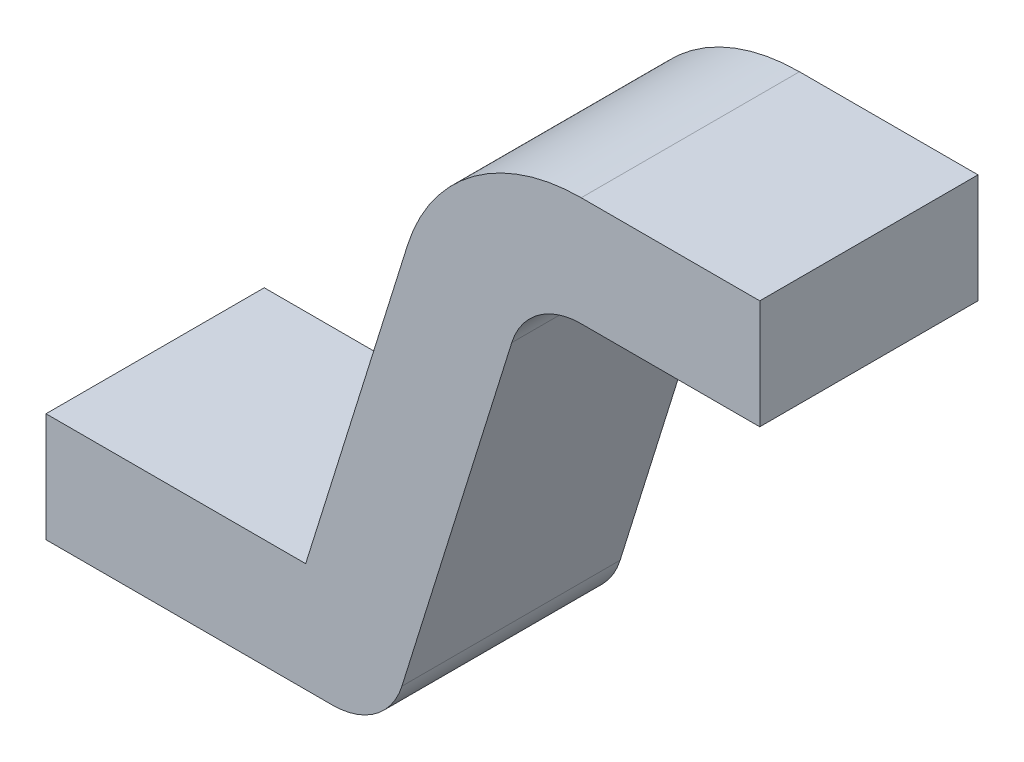
ISO-10303-21;
HEADER;
FILE_DESCRIPTION(('STEP AP214'),'2;1');
FILE_NAME('part.step','',(''),(''),'','','');
FILE_SCHEMA(('AUTOMOTIVE_DESIGN { 1 0 10303 214 1 1 1 1 }'));
ENDSEC;
DATA;
#1=APPLICATION_CONTEXT('core data for automotive mechanical design processes');
#2=APPLICATION_PROTOCOL_DEFINITION('international standard','automotive_design',2000,#1);
#3=PRODUCT_CONTEXT('',#1,'mechanical');
#4=PRODUCT('Part','Part','',(#3));
#5=PRODUCT_RELATED_PRODUCT_CATEGORY('part','',(#4));
#6=PRODUCT_DEFINITION_FORMATION('','',#4);
#7=PRODUCT_DEFINITION_CONTEXT('part definition',#1,'design');
#8=PRODUCT_DEFINITION('design','',#6,#7);
#9=PRODUCT_DEFINITION_SHAPE('','',#8);
#10=(LENGTH_UNIT() NAMED_UNIT(*) SI_UNIT(.MILLI.,.METRE.));
#11=(NAMED_UNIT(*) PLANE_ANGLE_UNIT() SI_UNIT($,.RADIAN.));
#12=(NAMED_UNIT(*) SI_UNIT($,.STERADIAN.) SOLID_ANGLE_UNIT());
#13=UNCERTAINTY_MEASURE_WITH_UNIT(LENGTH_MEASURE(1.E-05),#10,'distance_accuracy_value','');
#14=(GEOMETRIC_REPRESENTATION_CONTEXT(3) GLOBAL_UNCERTAINTY_ASSIGNED_CONTEXT((#13)) GLOBAL_UNIT_ASSIGNED_CONTEXT((#10,
#11,#12)) REPRESENTATION_CONTEXT('',''));
#15=CARTESIAN_POINT('',(0.,0.,0.));
#16=DIRECTION('',(0.,0.,1.));
#17=DIRECTION('',(1.,0.,0.));
#18=AXIS2_PLACEMENT_3D('',#15,#16,#17);
#19=CARTESIAN_POINT('',(0.,0.15,0.3));
#20=DIRECTION('',(1.,0.,0.));
#21=DIRECTION('',(0.,0.,-1.));
#22=AXIS2_PLACEMENT_3D('',#19,#20,#21);
#23=PLANE('',#22);
#24=DIRECTION('',(0.,-1.,0.));
#25=VECTOR('',#24,1.);
#26=CARTESIAN_POINT('',(0.,0.15,0.));
#27=LINE('',#26,#25);
#28=CARTESIAN_POINT('',(0.,0.15,0.));
#29=VERTEX_POINT('',#28);
#30=CARTESIAN_POINT('',(0.,0.,0.));
#31=VERTEX_POINT('',#30);
#32=EDGE_CURVE('E144',#29,#31,#27,.T.);
#33=ORIENTED_EDGE('',*,*,#32,.T.);
#34=DIRECTION('',(0.,0.,-1.));
#35=VECTOR('',#34,1.);
#36=CARTESIAN_POINT('',(0.,0.,0.3));
#37=LINE('',#36,#35);
#38=CARTESIAN_POINT('',(0.,0.,0.3));
#39=VERTEX_POINT('',#38);
#40=EDGE_CURVE('E11',#39,#31,#37,.T.);
#41=ORIENTED_EDGE('',*,*,#40,.F.);
#42=DIRECTION('',(0.,-1.,0.));
#43=VECTOR('',#42,1.);
#44=CARTESIAN_POINT('',(0.,0.15,0.3));
#45=LINE('',#44,#43);
#46=CARTESIAN_POINT('',(0.,0.15,0.3));
#47=VERTEX_POINT('',#46);
#48=EDGE_CURVE('E164',#47,#39,#45,.T.);
#49=ORIENTED_EDGE('',*,*,#48,.F.);
#50=DIRECTION('',(0.,0.,-1.));
#51=VECTOR('',#50,1.);
#52=CARTESIAN_POINT('',(0.,0.15,0.3));
#53=LINE('',#52,#51);
#54=EDGE_CURVE('E140',#47,#29,#53,.T.);
#55=ORIENTED_EDGE('',*,*,#54,.T.);
#56=EDGE_LOOP('',(#33,#41,#49,#55));
#57=FACE_BOUND('',#56,.T.);
#58=ADVANCED_FACE('F30',(#57),#23,.F.);
#59=CARTESIAN_POINT('',(0.,0.,0.3));
#60=DIRECTION('',(0.,1.,0.));
#61=DIRECTION('',(0.,0.,1.));
#62=AXIS2_PLACEMENT_3D('',#59,#60,#61);
#63=PLANE('',#62);
#64=DIRECTION('',(1.,0.,0.));
#65=VECTOR('',#64,1.);
#66=CARTESIAN_POINT('',(0.,0.,0.));
#67=LINE('',#66,#65);
#68=CARTESIAN_POINT('',(0.393749668926178,0.,0.));
#69=VERTEX_POINT('',#68);
#70=EDGE_CURVE('E147',#31,#69,#67,.T.);
#71=ORIENTED_EDGE('',*,*,#70,.T.);
#72=DIRECTION('',(0.,0.,-1.));
#73=VECTOR('',#72,1.);
#74=CARTESIAN_POINT('',(0.393749668926178,0.,0.3));
#75=LINE('',#74,#73);
#76=CARTESIAN_POINT('',(0.393749668926178,0.,0.3));
#77=VERTEX_POINT('',#76);
#78=EDGE_CURVE('E38',#77,#69,#75,.T.);
#79=ORIENTED_EDGE('',*,*,#78,.F.);
#80=DIRECTION('',(1.,0.,0.));
#81=VECTOR('',#80,1.);
#82=CARTESIAN_POINT('',(0.,0.,0.3));
#83=LINE('',#82,#81);
#84=EDGE_CURVE('E98',#39,#77,#83,.T.);
#85=ORIENTED_EDGE('',*,*,#84,.F.);
#86=ORIENTED_EDGE('',*,*,#40,.T.);
#87=EDGE_LOOP('',(#71,#79,#85,#86));
#88=FACE_BOUND('',#87,.T.);
#89=ADVANCED_FACE('F236',(#88),#63,.F.);
#90=CARTESIAN_POINT('',(0.393749668926178,0.1,0.3));
#91=DIRECTION('',(0.,0.,-1.));
#92=DIRECTION('',(-1.,0.,0.));
#93=AXIS2_PLACEMENT_3D('',#90,#91,#92);
#94=CYLINDRICAL_SURFACE('',#93,0.1);
#95=CARTESIAN_POINT('',(0.393749668926178,0.1,0.));
#96=DIRECTION('',(0.,0.,1.));
#97=DIRECTION('',(-1.,0.,0.));
#98=AXIS2_PLACEMENT_3D('',#95,#96,#97);
#99=CIRCLE('',#98,0.1);
#100=CARTESIAN_POINT('',(0.489218964277052,0.0702407384969382,0.));
#101=VERTEX_POINT('',#100);
#102=EDGE_CURVE('E149',#69,#101,#99,.T.);
#103=ORIENTED_EDGE('',*,*,#102,.T.);
#104=DIRECTION('',(0.,0.,-1.));
#105=VECTOR('',#104,1.);
#106=CARTESIAN_POINT('',(0.489218964277052,0.0702407384969382,0.3));
#107=LINE('',#106,#105);
#108=CARTESIAN_POINT('',(0.489218964277052,0.0702407384969382,0.3));
#109=VERTEX_POINT('',#108);
#110=EDGE_CURVE('E180',#109,#101,#107,.T.);
#111=ORIENTED_EDGE('',*,*,#110,.F.);
#112=CARTESIAN_POINT('',(0.393749668926178,0.1,0.3));
#113=DIRECTION('',(0.,0.,1.));
#114=DIRECTION('',(-1.,0.,0.));
#115=AXIS2_PLACEMENT_3D('',#112,#113,#114);
#116=CIRCLE('',#115,0.1);
#117=EDGE_CURVE('E188',#77,#109,#116,.T.);
#118=ORIENTED_EDGE('',*,*,#117,.F.);
#119=ORIENTED_EDGE('',*,*,#78,.T.);
#120=EDGE_LOOP('',(#103,#111,#118,#119));
#121=FACE_BOUND('',#120,.T.);
#122=ADVANCED_FACE('F186',(#121),#94,.T.);
#123=CARTESIAN_POINT('',(0.489218964277052,0.0702407384969381,0.3));
#124=DIRECTION('',(-0.954692953508738,0.297592615030619,0.));
#125=DIRECTION('',(-0.297592615030619,-0.954692953508738,0.));
#126=AXIS2_PLACEMENT_3D('',#123,#124,#125);
#127=PLANE('',#126);
#128=DIRECTION('',(0.297592615030619,0.954692953508738,0.));
#129=VECTOR('',#128,1.);
#130=CARTESIAN_POINT('',(0.489218964277052,0.0702407384969381,0.));
#131=LINE('',#130,#129);
#132=CARTESIAN_POINT('',(0.640250909953653,0.554759261503062,0.));
#133=VERTEX_POINT('',#132);
#134=EDGE_CURVE('E151',#101,#133,#131,.T.);
#135=ORIENTED_EDGE('',*,*,#134,.T.);
#136=DIRECTION('',(0.,0.,-1.));
#137=VECTOR('',#136,1.);
#138=CARTESIAN_POINT('',(0.640250909953653,0.554759261503062,0.3));
#139=LINE('',#138,#137);
#140=CARTESIAN_POINT('',(0.640250909953653,0.554759261503062,0.3));
#141=VERTEX_POINT('',#140);
#142=EDGE_CURVE('E177',#141,#133,#139,.T.);
#143=ORIENTED_EDGE('',*,*,#142,.F.);
#144=DIRECTION('',(0.297592615030619,0.954692953508738,0.));
#145=VECTOR('',#144,1.);
#146=CARTESIAN_POINT('',(0.489218964277052,0.0702407384969381,0.3));
#147=LINE('',#146,#145);
#148=EDGE_CURVE('E206',#109,#141,#147,.T.);
#149=ORIENTED_EDGE('',*,*,#148,.F.);
#150=ORIENTED_EDGE('',*,*,#110,.T.);
#151=EDGE_LOOP('',(#135,#143,#149,#150));
#152=FACE_BOUND('',#151,.T.);
#153=ADVANCED_FACE('F197',(#152),#127,.F.);
#154=CARTESIAN_POINT('',(0.735720205304527,0.525,0.3));
#155=DIRECTION('',(0.,0.,-1.));
#156=DIRECTION('',(-1.,0.,0.));
#157=AXIS2_PLACEMENT_3D('',#154,#155,#156);
#158=CYLINDRICAL_SURFACE('',#157,0.1);
#159=CARTESIAN_POINT('',(0.735720205304527,0.525,0.));
#160=DIRECTION('',(0.,0.,-1.));
#161=DIRECTION('',(1.,0.,0.));
#162=AXIS2_PLACEMENT_3D('',#159,#160,#161);
#163=CIRCLE('',#162,0.1);
#164=CARTESIAN_POINT('',(0.735720205304527,0.625,0.));
#165=VERTEX_POINT('',#164);
#166=EDGE_CURVE('E153',#133,#165,#163,.T.);
#167=ORIENTED_EDGE('',*,*,#166,.T.);
#168=DIRECTION('',(0.,0.,-1.));
#169=VECTOR('',#168,1.);
#170=CARTESIAN_POINT('',(0.735720205304527,0.625,0.3));
#171=LINE('',#170,#169);
#172=CARTESIAN_POINT('',(0.735720205304527,0.625,0.3));
#173=VERTEX_POINT('',#172);
#174=EDGE_CURVE('E174',#173,#165,#171,.T.);
#175=ORIENTED_EDGE('',*,*,#174,.F.);
#176=CARTESIAN_POINT('',(0.735720205304527,0.525,0.3));
#177=DIRECTION('',(0.,0.,-1.));
#178=DIRECTION('',(1.,0.,0.));
#179=AXIS2_PLACEMENT_3D('',#176,#177,#178);
#180=CIRCLE('',#179,0.1);
#181=EDGE_CURVE('E203',#141,#173,#180,.T.);
#182=ORIENTED_EDGE('',*,*,#181,.F.);
#183=ORIENTED_EDGE('',*,*,#142,.T.);
#184=EDGE_LOOP('',(#167,#175,#182,#183));
#185=FACE_BOUND('',#184,.T.);
#186=ADVANCED_FACE('F201',(#185),#158,.F.);
#187=CARTESIAN_POINT('',(0.735720205304527,0.625,0.3));
#188=DIRECTION('',(0.,1.,0.));
#189=DIRECTION('',(-1.,0.,0.));
#190=AXIS2_PLACEMENT_3D('',#187,#188,#189);
#191=PLANE('',#190);
#192=DIRECTION('',(1.,0.,0.));
#193=VECTOR('',#192,1.);
#194=CARTESIAN_POINT('',(0.735720205304527,0.625,0.));
#195=LINE('',#194,#193);
#196=CARTESIAN_POINT('',(0.981168201486143,0.625,0.));
#197=VERTEX_POINT('',#196);
#198=EDGE_CURVE('E155',#165,#197,#195,.T.);
#199=ORIENTED_EDGE('',*,*,#198,.T.);
#200=DIRECTION('',(0.,0.,-1.));
#201=VECTOR('',#200,1.);
#202=CARTESIAN_POINT('',(0.981168201486143,0.625,0.3));
#203=LINE('',#202,#201);
#204=CARTESIAN_POINT('',(0.981168201486143,0.625,0.3));
#205=VERTEX_POINT('',#204);
#206=EDGE_CURVE('E171',#205,#197,#203,.T.);
#207=ORIENTED_EDGE('',*,*,#206,.F.);
#208=DIRECTION('',(1.,0.,0.));
#209=VECTOR('',#208,1.);
#210=CARTESIAN_POINT('',(0.735720205304527,0.625,0.3));
#211=LINE('',#210,#209);
#212=EDGE_CURVE('E205',#173,#205,#211,.T.);
#213=ORIENTED_EDGE('',*,*,#212,.F.);
#214=ORIENTED_EDGE('',*,*,#174,.T.);
#215=EDGE_LOOP('',(#199,#207,#213,#214));
#216=FACE_BOUND('',#215,.T.);
#217=ADVANCED_FACE('F249',(#216),#191,.F.);
#218=CARTESIAN_POINT('',(0.981168201486143,0.775,0.3));
#219=DIRECTION('',(-1.,0.,0.));
#220=DIRECTION('',(0.,0.,1.));
#221=AXIS2_PLACEMENT_3D('',#218,#219,#220);
#222=PLANE('',#221);
#223=DIRECTION('',(0.,1.,0.));
#224=VECTOR('',#223,1.);
#225=CARTESIAN_POINT('',(0.981168201486143,0.775,0.));
#226=LINE('',#225,#224);
#227=CARTESIAN_POINT('',(0.981168201486143,0.775,0.));
#228=VERTEX_POINT('',#227);
#229=EDGE_CURVE('E157',#197,#228,#226,.T.);
#230=ORIENTED_EDGE('',*,*,#229,.T.);
#231=DIRECTION('',(0.,0.,-1.));
#232=VECTOR('',#231,1.);
#233=CARTESIAN_POINT('',(0.981168201486143,0.775,0.3));
#234=LINE('',#233,#232);
#235=CARTESIAN_POINT('',(0.981168201486143,0.775,0.3));
#236=VERTEX_POINT('',#235);
#237=EDGE_CURVE('E168',#236,#228,#234,.T.);
#238=ORIENTED_EDGE('',*,*,#237,.F.);
#239=DIRECTION('',(0.,1.,0.));
#240=VECTOR('',#239,1.);
#241=CARTESIAN_POINT('',(0.981168201486143,0.775,0.3));
#242=LINE('',#241,#240);
#243=EDGE_CURVE('E208',#205,#236,#242,.T.);
#244=ORIENTED_EDGE('',*,*,#243,.F.);
#245=ORIENTED_EDGE('',*,*,#206,.T.);
#246=EDGE_LOOP('',(#230,#238,#244,#245));
#247=FACE_BOUND('',#246,.T.);
#248=ADVANCED_FACE('F217',(#247),#222,.F.);
#249=CARTESIAN_POINT('',(0.735720205304527,0.775,0.3));
#250=DIRECTION('',(0.,-1.,0.));
#251=DIRECTION('',(0.,0.,-1.));
#252=AXIS2_PLACEMENT_3D('',#249,#250,#251);
#253=PLANE('',#252);
#254=DIRECTION('',(-1.,0.,0.));
#255=VECTOR('',#254,1.);
#256=CARTESIAN_POINT('',(0.735720205304527,0.775,0.));
#257=LINE('',#256,#255);
#258=CARTESIAN_POINT('',(0.735720205304527,0.775,0.));
#259=VERTEX_POINT('',#258);
#260=EDGE_CURVE('E159',#228,#259,#257,.T.);
#261=ORIENTED_EDGE('',*,*,#260,.T.);
#262=DIRECTION('',(0.,0.,-1.));
#263=VECTOR('',#262,1.);
#264=CARTESIAN_POINT('',(0.735720205304527,0.775,0.3));
#265=LINE('',#264,#263);
#266=CARTESIAN_POINT('',(0.735720205304527,0.775,0.3));
#267=VERTEX_POINT('',#266);
#268=EDGE_CURVE('E135',#267,#259,#265,.T.);
#269=ORIENTED_EDGE('',*,*,#268,.F.);
#270=DIRECTION('',(-1.,0.,0.));
#271=VECTOR('',#270,1.);
#272=CARTESIAN_POINT('',(0.735720205304527,0.775,0.3));
#273=LINE('',#272,#271);
#274=EDGE_CURVE('E126',#236,#267,#273,.T.);
#275=ORIENTED_EDGE('',*,*,#274,.F.);
#276=ORIENTED_EDGE('',*,*,#237,.T.);
#277=EDGE_LOOP('',(#261,#269,#275,#276));
#278=FACE_BOUND('',#277,.T.);
#279=ADVANCED_FACE('F221',(#278),#253,.F.);
#280=CARTESIAN_POINT('',(0.735720205304527,0.525,0.3));
#281=DIRECTION('',(0.,0.,-1.));
#282=DIRECTION('',(-1.,0.,0.));
#283=AXIS2_PLACEMENT_3D('',#280,#281,#282);
#284=CYLINDRICAL_SURFACE('',#283,0.25);
#285=CARTESIAN_POINT('',(0.735720205304527,0.525,0.));
#286=DIRECTION('',(0.,0.,1.));
#287=DIRECTION('',(1.,0.,0.));
#288=AXIS2_PLACEMENT_3D('',#285,#286,#287);
#289=CIRCLE('',#288,0.25);
#290=CARTESIAN_POINT('',(0.497046966927342,0.599398153757655,0.));
#291=VERTEX_POINT('',#290);
#292=EDGE_CURVE('E134',#259,#291,#289,.T.);
#293=ORIENTED_EDGE('',*,*,#292,.T.);
#294=DIRECTION('',(0.,0.,-1.));
#295=VECTOR('',#294,1.);
#296=CARTESIAN_POINT('',(0.497046966927342,0.599398153757655,0.3));
#297=LINE('',#296,#295);
#298=CARTESIAN_POINT('',(0.497046966927342,0.599398153757655,0.3));
#299=VERTEX_POINT('',#298);
#300=EDGE_CURVE('E131',#299,#291,#297,.T.);
#301=ORIENTED_EDGE('',*,*,#300,.F.);
#302=CARTESIAN_POINT('',(0.735720205304527,0.525,0.3));
#303=DIRECTION('',(0.,0.,1.));
#304=DIRECTION('',(1.,0.,0.));
#305=AXIS2_PLACEMENT_3D('',#302,#303,#304);
#306=CIRCLE('',#305,0.25);
#307=EDGE_CURVE('E120',#267,#299,#306,.T.);
#308=ORIENTED_EDGE('',*,*,#307,.F.);
#309=ORIENTED_EDGE('',*,*,#268,.T.);
#310=EDGE_LOOP('',(#293,#301,#308,#309));
#311=FACE_BOUND('',#310,.T.);
#312=ADVANCED_FACE('F132',(#311),#284,.T.);
#313=CARTESIAN_POINT('',(0.356962585582374,0.15,0.3));
#314=DIRECTION('',(0.954692953508738,-0.297592615030619,0.));
#315=DIRECTION('',(0.297592615030619,0.954692953508738,0.));
#316=AXIS2_PLACEMENT_3D('',#313,#314,#315);
#317=PLANE('',#316);
#318=DIRECTION('',(-0.297592615030619,-0.954692953508739,0.));
#319=VECTOR('',#318,1.);
#320=CARTESIAN_POINT('',(0.356962585582374,0.15,0.));
#321=LINE('',#320,#319);
#322=CARTESIAN_POINT('',(0.356962585582374,0.15,0.));
#323=VERTEX_POINT('',#322);
#324=EDGE_CURVE('E84',#291,#323,#321,.T.);
#325=ORIENTED_EDGE('',*,*,#324,.T.);
#326=DIRECTION('',(0.,0.,-1.));
#327=VECTOR('',#326,1.);
#328=CARTESIAN_POINT('',(0.356962585582374,0.15,0.3));
#329=LINE('',#328,#327);
#330=CARTESIAN_POINT('',(0.356962585582374,0.15,0.3));
#331=VERTEX_POINT('',#330);
#332=EDGE_CURVE('E136',#331,#323,#329,.T.);
#333=ORIENTED_EDGE('',*,*,#332,.F.);
#334=DIRECTION('',(-0.297592615030619,-0.954692953508739,0.));
#335=VECTOR('',#334,1.);
#336=CARTESIAN_POINT('',(0.356962585582374,0.15,0.3));
#337=LINE('',#336,#335);
#338=EDGE_CURVE('E124',#299,#331,#337,.T.);
#339=ORIENTED_EDGE('',*,*,#338,.F.);
#340=ORIENTED_EDGE('',*,*,#300,.T.);
#341=EDGE_LOOP('',(#325,#333,#339,#340));
#342=FACE_BOUND('',#341,.T.);
#343=ADVANCED_FACE('F138',(#342),#317,.F.);
#344=CARTESIAN_POINT('',(0.,0.15,0.3));
#345=DIRECTION('',(0.,-1.,0.));
#346=DIRECTION('',(0.,0.,-1.));
#347=AXIS2_PLACEMENT_3D('',#344,#345,#346);
#348=PLANE('',#347);
#349=DIRECTION('',(-1.,0.,0.));
#350=VECTOR('',#349,1.);
#351=CARTESIAN_POINT('',(0.,0.15,0.));
#352=LINE('',#351,#350);
#353=EDGE_CURVE('E90',#323,#29,#352,.T.);
#354=ORIENTED_EDGE('',*,*,#353,.T.);
#355=ORIENTED_EDGE('',*,*,#54,.F.);
#356=DIRECTION('',(-1.,0.,0.));
#357=VECTOR('',#356,1.);
#358=CARTESIAN_POINT('',(0.,0.15,0.3));
#359=LINE('',#358,#357);
#360=EDGE_CURVE('E46',#331,#47,#359,.T.);
#361=ORIENTED_EDGE('',*,*,#360,.F.);
#362=ORIENTED_EDGE('',*,*,#332,.T.);
#363=EDGE_LOOP('',(#354,#355,#361,#362));
#364=FACE_BOUND('',#363,.T.);
#365=ADVANCED_FACE('F225',(#364),#348,.F.);
#366=CARTESIAN_POINT('',(0.393749668926178,0.1,0.3));
#367=DIRECTION('',(0.,0.,-1.));
#368=DIRECTION('',(-1.,0.,0.));
#369=AXIS2_PLACEMENT_3D('',#366,#367,#368);
#370=PLANE('',#369);
#371=ORIENTED_EDGE('',*,*,#48,.T.);
#372=ORIENTED_EDGE('',*,*,#84,.T.);
#373=ORIENTED_EDGE('',*,*,#117,.T.);
#374=ORIENTED_EDGE('',*,*,#148,.T.);
#375=ORIENTED_EDGE('',*,*,#181,.T.);
#376=ORIENTED_EDGE('',*,*,#212,.T.);
#377=ORIENTED_EDGE('',*,*,#243,.T.);
#378=ORIENTED_EDGE('',*,*,#274,.T.);
#379=ORIENTED_EDGE('',*,*,#307,.T.);
#380=ORIENTED_EDGE('',*,*,#338,.T.);
#381=ORIENTED_EDGE('',*,*,#360,.T.);
#382=EDGE_LOOP('',(#371,#372,#373,#374,#375,#376,#377,#378,#379,#380,#381));
#383=FACE_BOUND('',#382,.T.);
#384=ADVANCED_FACE('F122',(#383),#370,.F.);
#385=CARTESIAN_POINT('',(0.393749668926178,0.1,0.));
#386=DIRECTION('',(0.,0.,-1.));
#387=DIRECTION('',(-1.,0.,0.));
#388=AXIS2_PLACEMENT_3D('',#385,#386,#387);
#389=PLANE('',#388);
#390=ORIENTED_EDGE('',*,*,#32,.F.);
#391=ORIENTED_EDGE('',*,*,#353,.F.);
#392=ORIENTED_EDGE('',*,*,#324,.F.);
#393=ORIENTED_EDGE('',*,*,#292,.F.);
#394=ORIENTED_EDGE('',*,*,#260,.F.);
#395=ORIENTED_EDGE('',*,*,#229,.F.);
#396=ORIENTED_EDGE('',*,*,#198,.F.);
#397=ORIENTED_EDGE('',*,*,#166,.F.);
#398=ORIENTED_EDGE('',*,*,#134,.F.);
#399=ORIENTED_EDGE('',*,*,#102,.F.);
#400=ORIENTED_EDGE('',*,*,#70,.F.);
#401=EDGE_LOOP('',(#390,#391,#392,#393,#394,#395,#396,#397,#398,#399,#400));
#402=FACE_BOUND('',#401,.T.);
#403=ADVANCED_FACE('F192',(#402),#389,.T.);
#404=CLOSED_SHELL('',(#58,#89,#122,#153,#186,#217,#248,#279,#312,#343,#365,#384,#403));
#405=MANIFOLD_SOLID_BREP('B2',#404);
#406=ADVANCED_BREP_SHAPE_REPRESENTATION('',(#18,#405),#14);
#407=SHAPE_DEFINITION_REPRESENTATION(#9,#406);
ENDSEC;
END-ISO-10303-21;
